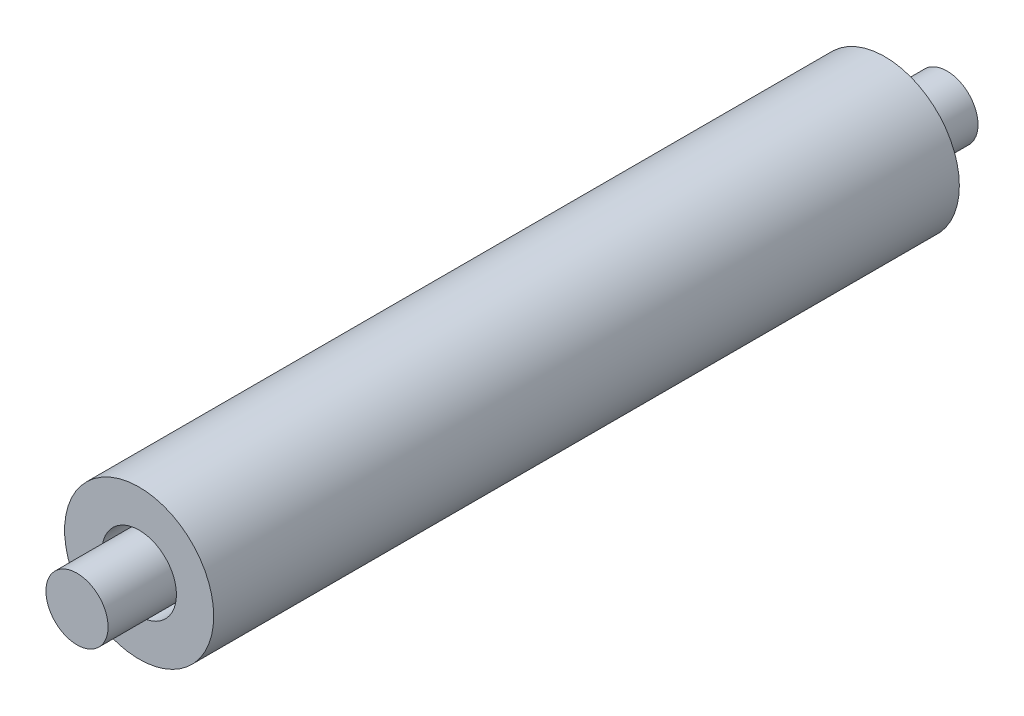
ISO-10303-21;
HEADER;
FILE_DESCRIPTION(('STEP AP214'),'2;1');
FILE_NAME('part.step','',(''),(''),'','','');
FILE_SCHEMA(('AUTOMOTIVE_DESIGN { 1 0 10303 214 1 1 1 1 }'));
ENDSEC;
DATA;
#1=APPLICATION_CONTEXT('core data for automotive mechanical design processes');
#2=APPLICATION_PROTOCOL_DEFINITION('international standard','automotive_design',2000,#1);
#3=PRODUCT_CONTEXT('',#1,'mechanical');
#4=PRODUCT('Part','Part','',(#3));
#5=PRODUCT_RELATED_PRODUCT_CATEGORY('part','',(#4));
#6=PRODUCT_DEFINITION_FORMATION('','',#4);
#7=PRODUCT_DEFINITION_CONTEXT('part definition',#1,'design');
#8=PRODUCT_DEFINITION('design','',#6,#7);
#9=PRODUCT_DEFINITION_SHAPE('','',#8);
#10=(LENGTH_UNIT() NAMED_UNIT(*) SI_UNIT(.MILLI.,.METRE.));
#11=(NAMED_UNIT(*) PLANE_ANGLE_UNIT() SI_UNIT($,.RADIAN.));
#12=(NAMED_UNIT(*) SI_UNIT($,.STERADIAN.) SOLID_ANGLE_UNIT());
#13=UNCERTAINTY_MEASURE_WITH_UNIT(LENGTH_MEASURE(1.E-05),#10,'distance_accuracy_value','');
#14=(GEOMETRIC_REPRESENTATION_CONTEXT(3) GLOBAL_UNCERTAINTY_ASSIGNED_CONTEXT((#13)) GLOBAL_UNIT_ASSIGNED_CONTEXT((#10,
#11,#12)) REPRESENTATION_CONTEXT('',''));
#15=CARTESIAN_POINT('',(0.,0.,0.));
#16=DIRECTION('',(0.,0.,1.));
#17=DIRECTION('',(1.,0.,0.));
#18=AXIS2_PLACEMENT_3D('',#15,#16,#17);
#19=CARTESIAN_POINT('',(0.,0.,15.));
#20=DIRECTION('',(0.,0.,1.));
#21=DIRECTION('',(1.,0.,0.));
#22=AXIS2_PLACEMENT_3D('',#19,#20,#21);
#23=PLANE('',#22);
#24=CARTESIAN_POINT('',(0.,0.,15.));
#25=DIRECTION('',(0.,0.,1.));
#26=DIRECTION('',(1.,0.,0.));
#27=AXIS2_PLACEMENT_3D('',#24,#25,#26);
#28=CIRCLE('',#27,3.);
#29=CARTESIAN_POINT('',(3.,0.,15.));
#30=VERTEX_POINT('',#29);
#31=EDGE_CURVE('E11',#30,#30,#28,.T.);
#32=ORIENTED_EDGE('',*,*,#31,.T.);
#33=EDGE_LOOP('',(#32));
#34=FACE_BOUND('',#33,.T.);
#35=CARTESIAN_POINT('',(0.,0.,15.));
#36=DIRECTION('',(0.,0.,1.));
#37=DIRECTION('',(1.,0.,0.));
#38=AXIS2_PLACEMENT_3D('',#35,#36,#37);
#39=CIRCLE('',#38,1.5);
#40=CARTESIAN_POINT('',(1.5,0.,15.));
#41=VERTEX_POINT('',#40);
#42=EDGE_CURVE('E50',#41,#41,#39,.T.);
#43=ORIENTED_EDGE('',*,*,#42,.F.);
#44=EDGE_LOOP('',(#43));
#45=FACE_BOUND('',#44,.T.);
#46=ADVANCED_FACE('F39',(#34,#45),#23,.T.);
#47=CARTESIAN_POINT('',(0.,0.,-15.));
#48=DIRECTION('',(0.,0.,1.));
#49=DIRECTION('',(1.,0.,0.));
#50=AXIS2_PLACEMENT_3D('',#47,#48,#49);
#51=PLANE('',#50);
#52=CARTESIAN_POINT('',(0.,0.,-15.));
#53=DIRECTION('',(0.,0.,1.));
#54=DIRECTION('',(1.,0.,0.));
#55=AXIS2_PLACEMENT_3D('',#52,#53,#54);
#56=CIRCLE('',#55,3.);
#57=CARTESIAN_POINT('',(3.,0.,-15.));
#58=VERTEX_POINT('',#57);
#59=EDGE_CURVE('E43',#58,#58,#56,.T.);
#60=ORIENTED_EDGE('',*,*,#59,.F.);
#61=EDGE_LOOP('',(#60));
#62=FACE_BOUND('',#61,.T.);
#63=CARTESIAN_POINT('',(0.,0.,-15.));
#64=DIRECTION('',(0.,0.,1.));
#65=DIRECTION('',(1.,0.,0.));
#66=AXIS2_PLACEMENT_3D('',#63,#64,#65);
#67=CIRCLE('',#66,1.5);
#68=CARTESIAN_POINT('',(1.5,0.,-15.));
#69=VERTEX_POINT('',#68);
#70=EDGE_CURVE('E52',#69,#69,#67,.T.);
#71=ORIENTED_EDGE('',*,*,#70,.T.);
#72=EDGE_LOOP('',(#71));
#73=FACE_BOUND('',#72,.T.);
#74=ADVANCED_FACE('F62',(#62,#73),#51,.F.);
#75=CARTESIAN_POINT('',(0.,0.,15.));
#76=DIRECTION('',(0.,0.,-1.));
#77=DIRECTION('',(-1.,0.,0.));
#78=AXIS2_PLACEMENT_3D('',#75,#76,#77);
#79=CYLINDRICAL_SURFACE('',#78,3.);
#80=ORIENTED_EDGE('',*,*,#31,.F.);
#81=EDGE_LOOP('',(#80));
#82=FACE_BOUND('',#81,.T.);
#83=ORIENTED_EDGE('',*,*,#59,.T.);
#84=EDGE_LOOP('',(#83));
#85=FACE_BOUND('',#84,.T.);
#86=ADVANCED_FACE('F41',(#82,#85),#79,.T.);
#87=CARTESIAN_POINT('',(0.,0.,15.));
#88=DIRECTION('',(0.,0.,-1.));
#89=DIRECTION('',(-1.,0.,0.));
#90=AXIS2_PLACEMENT_3D('',#87,#88,#89);
#91=CYLINDRICAL_SURFACE('',#90,1.5);
#92=ORIENTED_EDGE('',*,*,#42,.T.);
#93=EDGE_LOOP('',(#92));
#94=FACE_BOUND('',#93,.T.);
#95=ORIENTED_EDGE('',*,*,#70,.F.);
#96=EDGE_LOOP('',(#95));
#97=FACE_BOUND('',#96,.T.);
#98=ADVANCED_FACE('F58',(#94,#97),#91,.F.);
#99=CLOSED_SHELL('',(#46,#74,#86,#98));
#100=MANIFOLD_SOLID_BREP('B2',#99);
#101=CARTESIAN_POINT('',(0.,0.,17.5));
#102=DIRECTION('',(0.,0.,-1.));
#103=DIRECTION('',(-1.,0.,0.));
#104=AXIS2_PLACEMENT_3D('',#101,#102,#103);
#105=CYLINDRICAL_SURFACE('',#104,1.25);
#106=CARTESIAN_POINT('',(0.,0.,17.5));
#107=DIRECTION('',(0.,0.,1.));
#108=DIRECTION('',(1.,0.,0.));
#109=AXIS2_PLACEMENT_3D('',#106,#107,#108);
#110=CIRCLE('',#109,1.25);
#111=CARTESIAN_POINT('',(1.25,0.,17.5));
#112=VERTEX_POINT('',#111);
#113=EDGE_CURVE('E38',#112,#112,#110,.T.);
#114=ORIENTED_EDGE('',*,*,#113,.F.);
#115=EDGE_LOOP('',(#114));
#116=FACE_BOUND('',#115,.T.);
#117=CARTESIAN_POINT('',(0.,0.,-17.5));
#118=DIRECTION('',(0.,0.,1.));
#119=DIRECTION('',(1.,0.,0.));
#120=AXIS2_PLACEMENT_3D('',#117,#118,#119);
#121=CIRCLE('',#120,1.25);
#122=CARTESIAN_POINT('',(1.25,0.,-17.5));
#123=VERTEX_POINT('',#122);
#124=EDGE_CURVE('E104',#123,#123,#121,.T.);
#125=ORIENTED_EDGE('',*,*,#124,.T.);
#126=EDGE_LOOP('',(#125));
#127=FACE_BOUND('',#126,.T.);
#128=ADVANCED_FACE('F101',(#116,#127),#105,.T.);
#129=CARTESIAN_POINT('',(0.,0.,17.5));
#130=DIRECTION('',(0.,0.,1.));
#131=DIRECTION('',(1.,0.,0.));
#132=AXIS2_PLACEMENT_3D('',#129,#130,#131);
#133=PLANE('',#132);
#134=ORIENTED_EDGE('',*,*,#113,.T.);
#135=EDGE_LOOP('',(#134));
#136=FACE_BOUND('',#135,.T.);
#137=ADVANCED_FACE('F116',(#136),#133,.T.);
#138=CARTESIAN_POINT('',(0.,0.,-17.5));
#139=DIRECTION('',(0.,0.,1.));
#140=DIRECTION('',(1.,0.,0.));
#141=AXIS2_PLACEMENT_3D('',#138,#139,#140);
#142=PLANE('',#141);
#143=ORIENTED_EDGE('',*,*,#124,.F.);
#144=EDGE_LOOP('',(#143));
#145=FACE_BOUND('',#144,.T.);
#146=ADVANCED_FACE('F114',(#145),#142,.F.);
#147=CLOSED_SHELL('',(#128,#137,#146));
#148=MANIFOLD_SOLID_BREP('B6',#147);
#149=ADVANCED_BREP_SHAPE_REPRESENTATION('',(#18,#100,#148),#14);
#150=SHAPE_DEFINITION_REPRESENTATION(#9,#149);
ENDSEC;
END-ISO-10303-21;
